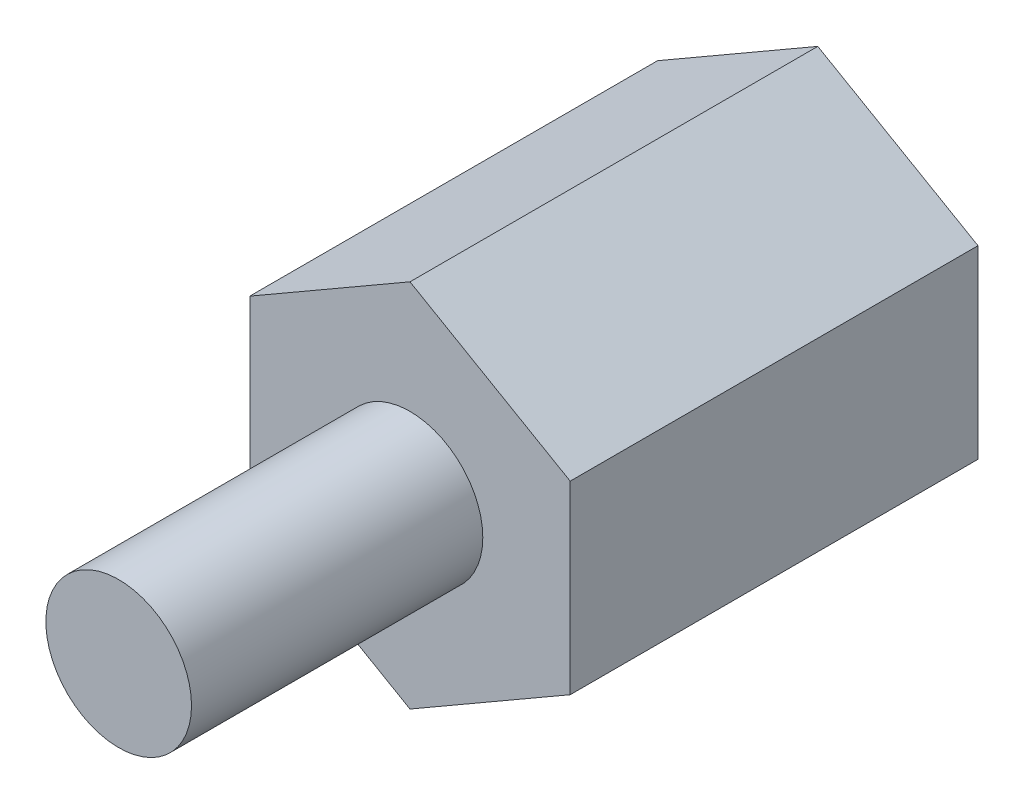
ISO-10303-21;
HEADER;
FILE_DESCRIPTION(('STEP AP214'),'2;1');
FILE_NAME('part.step','',(''),(''),'','','');
FILE_SCHEMA(('AUTOMOTIVE_DESIGN { 1 0 10303 214 1 1 1 1 }'));
ENDSEC;
DATA;
#1=APPLICATION_CONTEXT('core data for automotive mechanical design processes');
#2=APPLICATION_PROTOCOL_DEFINITION('international standard','automotive_design',2000,#1);
#3=PRODUCT_CONTEXT('',#1,'mechanical');
#4=PRODUCT('Part','Part','',(#3));
#5=PRODUCT_RELATED_PRODUCT_CATEGORY('part','',(#4));
#6=PRODUCT_DEFINITION_FORMATION('','',#4);
#7=PRODUCT_DEFINITION_CONTEXT('part definition',#1,'design');
#8=PRODUCT_DEFINITION('design','',#6,#7);
#9=PRODUCT_DEFINITION_SHAPE('','',#8);
#10=(LENGTH_UNIT() NAMED_UNIT(*) SI_UNIT(.MILLI.,.METRE.));
#11=(NAMED_UNIT(*) PLANE_ANGLE_UNIT() SI_UNIT($,.RADIAN.));
#12=(NAMED_UNIT(*) SI_UNIT($,.STERADIAN.) SOLID_ANGLE_UNIT());
#13=UNCERTAINTY_MEASURE_WITH_UNIT(LENGTH_MEASURE(1.E-05),#10,'distance_accuracy_value','');
#14=(GEOMETRIC_REPRESENTATION_CONTEXT(3) GLOBAL_UNCERTAINTY_ASSIGNED_CONTEXT((#13)) GLOBAL_UNIT_ASSIGNED_CONTEXT((#10,
#11,#12)) REPRESENTATION_CONTEXT('',''));
#15=CARTESIAN_POINT('',(0.,0.,0.));
#16=DIRECTION('',(0.,0.,1.));
#17=DIRECTION('',(1.,0.,0.));
#18=AXIS2_PLACEMENT_3D('',#15,#16,#17);
#19=CARTESIAN_POINT('',(2.75,1.58771324027147,-6.));
#20=DIRECTION('',(0.5,0.866025403784439,0.));
#21=DIRECTION('',(-0.866025403784439,0.5,0.));
#22=AXIS2_PLACEMENT_3D('',#19,#20,#21);
#23=PLANE('',#22);
#24=DIRECTION('',(0.,0.,1.));
#25=VECTOR('',#24,1.);
#26=CARTESIAN_POINT('',(0.,3.17542648054294,-6.));
#27=LINE('',#26,#25);
#28=CARTESIAN_POINT('',(0.,3.17542648054294,-6.));
#29=VERTEX_POINT('',#28);
#30=CARTESIAN_POINT('',(0.,3.17542648054294,0.999999999999999));
#31=VERTEX_POINT('',#30);
#32=EDGE_CURVE('E45',#29,#31,#27,.T.);
#33=ORIENTED_EDGE('',*,*,#32,.T.);
#34=DIRECTION('',(-0.866025403784439,0.5,0.));
#35=VECTOR('',#34,1.);
#36=CARTESIAN_POINT('',(1.375,2.38156986040721,1.));
#37=LINE('',#36,#35);
#38=CARTESIAN_POINT('',(2.75,1.58771324027147,1.));
#39=VERTEX_POINT('',#38);
#40=EDGE_CURVE('E58',#39,#31,#37,.T.);
#41=ORIENTED_EDGE('',*,*,#40,.F.);
#42=DIRECTION('',(0.,0.,1.));
#43=VECTOR('',#42,1.);
#44=CARTESIAN_POINT('',(2.75,1.58771324027147,-6.));
#45=LINE('',#44,#43);
#46=CARTESIAN_POINT('',(2.75,1.58771324027147,-6.));
#47=VERTEX_POINT('',#46);
#48=EDGE_CURVE('E11',#47,#39,#45,.T.);
#49=ORIENTED_EDGE('',*,*,#48,.F.);
#50=DIRECTION('',(-0.866025403784439,0.5,0.));
#51=VECTOR('',#50,1.);
#52=CARTESIAN_POINT('',(2.75,1.58771324027147,-6.));
#53=LINE('',#52,#51);
#54=EDGE_CURVE('E141',#47,#29,#53,.T.);
#55=ORIENTED_EDGE('',*,*,#54,.T.);
#56=EDGE_LOOP('',(#33,#41,#49,#55));
#57=FACE_BOUND('',#56,.T.);
#58=ADVANCED_FACE('F42',(#57),#23,.T.);
#59=CARTESIAN_POINT('',(2.75,-1.58771324027147,-6.));
#60=DIRECTION('',(1.,0.,0.));
#61=DIRECTION('',(0.,1.,0.));
#62=AXIS2_PLACEMENT_3D('',#59,#60,#61);
#63=PLANE('',#62);
#64=ORIENTED_EDGE('',*,*,#48,.T.);
#65=DIRECTION('',(0.,1.,0.));
#66=VECTOR('',#65,1.);
#67=CARTESIAN_POINT('',(2.75,0.,1.));
#68=LINE('',#67,#66);
#69=CARTESIAN_POINT('',(2.75,-1.58771324027147,1.));
#70=VERTEX_POINT('',#69);
#71=EDGE_CURVE('E93',#70,#39,#68,.T.);
#72=ORIENTED_EDGE('',*,*,#71,.F.);
#73=DIRECTION('',(0.,0.,1.));
#74=VECTOR('',#73,1.);
#75=CARTESIAN_POINT('',(2.75,-1.58771324027147,-6.));
#76=LINE('',#75,#74);
#77=CARTESIAN_POINT('',(2.75,-1.58771324027147,-6.));
#78=VERTEX_POINT('',#77);
#79=EDGE_CURVE('E50',#78,#70,#76,.T.);
#80=ORIENTED_EDGE('',*,*,#79,.F.);
#81=DIRECTION('',(0.,1.,0.));
#82=VECTOR('',#81,1.);
#83=CARTESIAN_POINT('',(2.75,-1.58771324027147,-6.));
#84=LINE('',#83,#82);
#85=EDGE_CURVE('E107',#78,#47,#84,.T.);
#86=ORIENTED_EDGE('',*,*,#85,.T.);
#87=EDGE_LOOP('',(#64,#72,#80,#86));
#88=FACE_BOUND('',#87,.T.);
#89=ADVANCED_FACE('F105',(#88),#63,.T.);
#90=CARTESIAN_POINT('',(0.,-3.17542648054294,-6.));
#91=DIRECTION('',(0.5,-0.866025403784439,0.));
#92=DIRECTION('',(0.866025403784439,0.5,0.));
#93=AXIS2_PLACEMENT_3D('',#90,#91,#92);
#94=PLANE('',#93);
#95=ORIENTED_EDGE('',*,*,#79,.T.);
#96=DIRECTION('',(0.866025403784439,0.5,0.));
#97=VECTOR('',#96,1.);
#98=CARTESIAN_POINT('',(1.375,-2.38156986040721,1.));
#99=LINE('',#98,#97);
#100=CARTESIAN_POINT('',(0.,-3.17542648054294,1.));
#101=VERTEX_POINT('',#100);
#102=EDGE_CURVE('E96',#101,#70,#99,.T.);
#103=ORIENTED_EDGE('',*,*,#102,.F.);
#104=DIRECTION('',(0.,0.,1.));
#105=VECTOR('',#104,1.);
#106=CARTESIAN_POINT('',(0.,-3.17542648054294,-6.));
#107=LINE('',#106,#105);
#108=CARTESIAN_POINT('',(0.,-3.17542648054294,-6.));
#109=VERTEX_POINT('',#108);
#110=EDGE_CURVE('E119',#109,#101,#107,.T.);
#111=ORIENTED_EDGE('',*,*,#110,.F.);
#112=DIRECTION('',(0.866025403784439,0.5,0.));
#113=VECTOR('',#112,1.);
#114=CARTESIAN_POINT('',(0.,-3.17542648054294,-6.));
#115=LINE('',#114,#113);
#116=EDGE_CURVE('E111',#109,#78,#115,.T.);
#117=ORIENTED_EDGE('',*,*,#116,.T.);
#118=EDGE_LOOP('',(#95,#103,#111,#117));
#119=FACE_BOUND('',#118,.T.);
#120=ADVANCED_FACE('F180',(#119),#94,.T.);
#121=CARTESIAN_POINT('',(-2.75,-1.58771324027147,-6.));
#122=DIRECTION('',(-0.5,-0.866025403784439,0.));
#123=DIRECTION('',(0.866025403784439,-0.5,0.));
#124=AXIS2_PLACEMENT_3D('',#121,#122,#123);
#125=PLANE('',#124);
#126=ORIENTED_EDGE('',*,*,#110,.T.);
#127=DIRECTION('',(0.866025403784439,-0.5,0.));
#128=VECTOR('',#127,1.);
#129=CARTESIAN_POINT('',(-1.375,-2.38156986040721,1.));
#130=LINE('',#129,#128);
#131=CARTESIAN_POINT('',(-2.75,-1.58771324027147,1.));
#132=VERTEX_POINT('',#131);
#133=EDGE_CURVE('E155',#132,#101,#130,.T.);
#134=ORIENTED_EDGE('',*,*,#133,.F.);
#135=DIRECTION('',(0.,0.,1.));
#136=VECTOR('',#135,1.);
#137=CARTESIAN_POINT('',(-2.75,-1.58771324027147,-6.));
#138=LINE('',#137,#136);
#139=CARTESIAN_POINT('',(-2.75,-1.58771324027147,-6.));
#140=VERTEX_POINT('',#139);
#141=EDGE_CURVE('E122',#140,#132,#138,.T.);
#142=ORIENTED_EDGE('',*,*,#141,.F.);
#143=DIRECTION('',(0.866025403784439,-0.5,0.));
#144=VECTOR('',#143,1.);
#145=CARTESIAN_POINT('',(-2.75,-1.58771324027147,-6.));
#146=LINE('',#145,#144);
#147=EDGE_CURVE('E114',#140,#109,#146,.T.);
#148=ORIENTED_EDGE('',*,*,#147,.T.);
#149=EDGE_LOOP('',(#126,#134,#142,#148));
#150=FACE_BOUND('',#149,.T.);
#151=ADVANCED_FACE('F185',(#150),#125,.T.);
#152=CARTESIAN_POINT('',(-2.75,1.58771324027147,-6.));
#153=DIRECTION('',(-1.,0.,0.));
#154=DIRECTION('',(0.,-1.,0.));
#155=AXIS2_PLACEMENT_3D('',#152,#153,#154);
#156=PLANE('',#155);
#157=ORIENTED_EDGE('',*,*,#141,.T.);
#158=DIRECTION('',(0.,-1.,0.));
#159=VECTOR('',#158,1.);
#160=CARTESIAN_POINT('',(-2.75,0.,1.));
#161=LINE('',#160,#159);
#162=CARTESIAN_POINT('',(-2.75,1.58771324027147,1.));
#163=VERTEX_POINT('',#162);
#164=EDGE_CURVE('E136',#163,#132,#161,.T.);
#165=ORIENTED_EDGE('',*,*,#164,.F.);
#166=DIRECTION('',(0.,0.,1.));
#167=VECTOR('',#166,1.);
#168=CARTESIAN_POINT('',(-2.75,1.58771324027147,-6.));
#169=LINE('',#168,#167);
#170=CARTESIAN_POINT('',(-2.75,1.58771324027147,-6.));
#171=VERTEX_POINT('',#170);
#172=EDGE_CURVE('E113',#171,#163,#169,.T.);
#173=ORIENTED_EDGE('',*,*,#172,.F.);
#174=DIRECTION('',(0.,-1.,0.));
#175=VECTOR('',#174,1.);
#176=CARTESIAN_POINT('',(-2.75,1.58771324027147,-6.));
#177=LINE('',#176,#175);
#178=EDGE_CURVE('E135',#171,#140,#177,.T.);
#179=ORIENTED_EDGE('',*,*,#178,.T.);
#180=EDGE_LOOP('',(#157,#165,#173,#179));
#181=FACE_BOUND('',#180,.T.);
#182=ADVANCED_FACE('F134',(#181),#156,.T.);
#183=CARTESIAN_POINT('',(0.,3.17542648054294,-6.));
#184=DIRECTION('',(-0.5,0.866025403784438,0.));
#185=DIRECTION('',(-0.866025403784438,-0.500000000000001,0.));
#186=AXIS2_PLACEMENT_3D('',#183,#184,#185);
#187=PLANE('',#186);
#188=ORIENTED_EDGE('',*,*,#172,.T.);
#189=DIRECTION('',(-0.866025403784438,-0.5,0.));
#190=VECTOR('',#189,1.);
#191=CARTESIAN_POINT('',(-1.375,2.3815698604072,1.));
#192=LINE('',#191,#190);
#193=EDGE_CURVE('E102',#31,#163,#192,.T.);
#194=ORIENTED_EDGE('',*,*,#193,.F.);
#195=ORIENTED_EDGE('',*,*,#32,.F.);
#196=DIRECTION('',(-0.866025403784438,-0.5,0.));
#197=VECTOR('',#196,1.);
#198=CARTESIAN_POINT('',(0.,3.17542648054294,-6.));
#199=LINE('',#198,#197);
#200=EDGE_CURVE('E129',#29,#171,#199,.T.);
#201=ORIENTED_EDGE('',*,*,#200,.T.);
#202=EDGE_LOOP('',(#188,#194,#195,#201));
#203=FACE_BOUND('',#202,.T.);
#204=ADVANCED_FACE('F127',(#203),#187,.T.);
#205=CARTESIAN_POINT('',(0.,0.,-6.));
#206=DIRECTION('',(0.,0.,1.));
#207=DIRECTION('',(1.,0.,0.));
#208=AXIS2_PLACEMENT_3D('',#205,#206,#207);
#209=PLANE('',#208);
#210=CARTESIAN_POINT('',(0.,0.,-6.));
#211=DIRECTION('',(0.,0.,-1.));
#212=DIRECTION('',(-1.,0.,0.));
#213=AXIS2_PLACEMENT_3D('',#210,#211,#212);
#214=CIRCLE('',#213,1.25);
#215=CARTESIAN_POINT('',(-1.25,0.,-6.));
#216=VERTEX_POINT('',#215);
#217=EDGE_CURVE('E146',#216,#216,#214,.T.);
#218=ORIENTED_EDGE('',*,*,#217,.F.);
#219=EDGE_LOOP('',(#218));
#220=FACE_BOUND('',#219,.T.);
#221=ORIENTED_EDGE('',*,*,#54,.F.);
#222=ORIENTED_EDGE('',*,*,#85,.F.);
#223=ORIENTED_EDGE('',*,*,#116,.F.);
#224=ORIENTED_EDGE('',*,*,#147,.F.);
#225=ORIENTED_EDGE('',*,*,#178,.F.);
#226=ORIENTED_EDGE('',*,*,#200,.F.);
#227=EDGE_LOOP('',(#221,#222,#223,#224,#225,#226));
#228=FACE_BOUND('',#227,.T.);
#229=ADVANCED_FACE('F138',(#220,#228),#209,.F.);
#230=CARTESIAN_POINT('',(0.,0.,-2.));
#231=DIRECTION('',(0.,0.,-1.));
#232=DIRECTION('',(-1.,0.,0.));
#233=AXIS2_PLACEMENT_3D('',#230,#231,#232);
#234=CYLINDRICAL_SURFACE('',#233,1.25);
#235=CARTESIAN_POINT('',(0.,0.,-2.));
#236=DIRECTION('',(0.,0.,-1.));
#237=DIRECTION('',(-1.,0.,0.));
#238=AXIS2_PLACEMENT_3D('',#235,#236,#237);
#239=CIRCLE('',#238,1.25);
#240=CARTESIAN_POINT('',(-1.25,0.,-2.));
#241=VERTEX_POINT('',#240);
#242=EDGE_CURVE('E145',#241,#241,#239,.T.);
#243=ORIENTED_EDGE('',*,*,#242,.F.);
#244=EDGE_LOOP('',(#243));
#245=FACE_BOUND('',#244,.T.);
#246=ORIENTED_EDGE('',*,*,#217,.T.);
#247=EDGE_LOOP('',(#246));
#248=FACE_BOUND('',#247,.T.);
#249=ADVANCED_FACE('F198',(#245,#248),#234,.F.);
#250=CARTESIAN_POINT('',(0.,0.,-2.));
#251=DIRECTION('',(0.,0.,-1.));
#252=DIRECTION('',(-1.,0.,0.));
#253=AXIS2_PLACEMENT_3D('',#250,#251,#252);
#254=PLANE('',#253);
#255=ORIENTED_EDGE('',*,*,#242,.T.);
#256=EDGE_LOOP('',(#255));
#257=FACE_BOUND('',#256,.T.);
#258=ADVANCED_FACE('F174',(#257),#254,.T.);
#259=CARTESIAN_POINT('',(0.,0.,1.));
#260=DIRECTION('',(0.,0.,1.));
#261=DIRECTION('',(1.,0.,0.));
#262=AXIS2_PLACEMENT_3D('',#259,#260,#261);
#263=CYLINDRICAL_SURFACE('',#262,1.25);
#264=CARTESIAN_POINT('',(0.,0.,1.));
#265=DIRECTION('',(0.,0.,1.));
#266=DIRECTION('',(1.,0.,0.));
#267=AXIS2_PLACEMENT_3D('',#264,#265,#266);
#268=CIRCLE('',#267,1.25);
#269=CARTESIAN_POINT('',(1.25,0.,1.));
#270=VERTEX_POINT('',#269);
#271=EDGE_CURVE('E99',#270,#270,#268,.T.);
#272=ORIENTED_EDGE('',*,*,#271,.T.);
#273=EDGE_LOOP('',(#272));
#274=FACE_BOUND('',#273,.T.);
#275=CARTESIAN_POINT('',(0.,0.,6.));
#276=DIRECTION('',(0.,0.,1.));
#277=DIRECTION('',(1.,0.,0.));
#278=AXIS2_PLACEMENT_3D('',#275,#276,#277);
#279=CIRCLE('',#278,1.25);
#280=CARTESIAN_POINT('',(1.25,0.,6.));
#281=VERTEX_POINT('',#280);
#282=EDGE_CURVE('E151',#281,#281,#279,.T.);
#283=ORIENTED_EDGE('',*,*,#282,.F.);
#284=EDGE_LOOP('',(#283));
#285=FACE_BOUND('',#284,.T.);
#286=ADVANCED_FACE('F162',(#274,#285),#263,.T.);
#287=CARTESIAN_POINT('',(0.,0.,1.));
#288=DIRECTION('',(0.,0.,1.));
#289=DIRECTION('',(1.,0.,0.));
#290=AXIS2_PLACEMENT_3D('',#287,#288,#289);
#291=PLANE('',#290);
#292=ORIENTED_EDGE('',*,*,#271,.F.);
#293=EDGE_LOOP('',(#292));
#294=FACE_BOUND('',#293,.T.);
#295=ORIENTED_EDGE('',*,*,#71,.T.);
#296=ORIENTED_EDGE('',*,*,#40,.T.);
#297=ORIENTED_EDGE('',*,*,#193,.T.);
#298=ORIENTED_EDGE('',*,*,#164,.T.);
#299=ORIENTED_EDGE('',*,*,#133,.T.);
#300=ORIENTED_EDGE('',*,*,#102,.T.);
#301=EDGE_LOOP('',(#295,#296,#297,#298,#299,#300));
#302=FACE_BOUND('',#301,.T.);
#303=ADVANCED_FACE('F94',(#294,#302),#291,.T.);
#304=CARTESIAN_POINT('',(0.,0.,6.));
#305=DIRECTION('',(0.,0.,1.));
#306=DIRECTION('',(1.,0.,0.));
#307=AXIS2_PLACEMENT_3D('',#304,#305,#306);
#308=PLANE('',#307);
#309=ORIENTED_EDGE('',*,*,#282,.T.);
#310=EDGE_LOOP('',(#309));
#311=FACE_BOUND('',#310,.T.);
#312=ADVANCED_FACE('F166',(#311),#308,.T.);
#313=CLOSED_SHELL('',(#58,#89,#120,#151,#182,#204,#229,#249,#258,#286,#303,#312));
#314=MANIFOLD_SOLID_BREP('B2',#313);
#315=ADVANCED_BREP_SHAPE_REPRESENTATION('',(#18,#314),#14);
#316=SHAPE_DEFINITION_REPRESENTATION(#9,#315);
ENDSEC;
END-ISO-10303-21;
